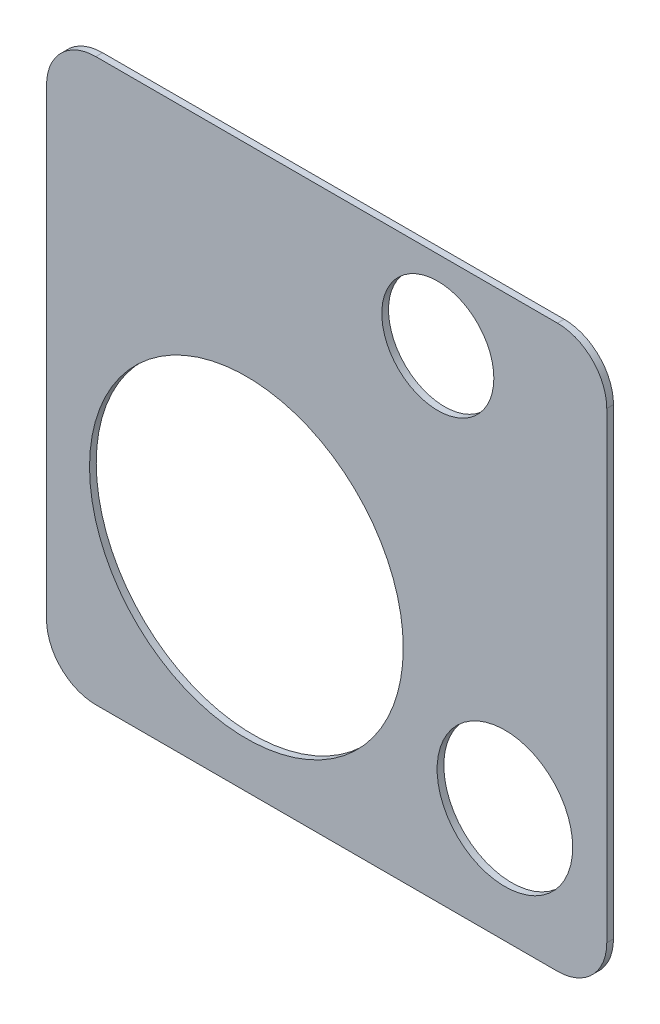
ISO-10303-21;
HEADER;
FILE_DESCRIPTION(('STEP AP214'),'2;1');
FILE_NAME('part.step','',(''),(''),'','','');
FILE_SCHEMA(('AUTOMOTIVE_DESIGN { 1 0 10303 214 1 1 1 1 }'));
ENDSEC;
DATA;
#1=APPLICATION_CONTEXT('core data for automotive mechanical design processes');
#2=APPLICATION_PROTOCOL_DEFINITION('international standard','automotive_design',2000,#1);
#3=PRODUCT_CONTEXT('',#1,'mechanical');
#4=PRODUCT('Part','Part','',(#3));
#5=PRODUCT_RELATED_PRODUCT_CATEGORY('part','',(#4));
#6=PRODUCT_DEFINITION_FORMATION('','',#4);
#7=PRODUCT_DEFINITION_CONTEXT('part definition',#1,'design');
#8=PRODUCT_DEFINITION('design','',#6,#7);
#9=PRODUCT_DEFINITION_SHAPE('','',#8);
#10=(LENGTH_UNIT() NAMED_UNIT(*) SI_UNIT(.MILLI.,.METRE.));
#11=(NAMED_UNIT(*) PLANE_ANGLE_UNIT() SI_UNIT($,.RADIAN.));
#12=(NAMED_UNIT(*) SI_UNIT($,.STERADIAN.) SOLID_ANGLE_UNIT());
#13=UNCERTAINTY_MEASURE_WITH_UNIT(LENGTH_MEASURE(1.E-05),#10,'distance_accuracy_value','');
#14=(GEOMETRIC_REPRESENTATION_CONTEXT(3) GLOBAL_UNCERTAINTY_ASSIGNED_CONTEXT((#13)) GLOBAL_UNIT_ASSIGNED_CONTEXT((#10,
#11,#12)) REPRESENTATION_CONTEXT('',''));
#15=CARTESIAN_POINT('',(0.,0.,0.));
#16=DIRECTION('',(0.,0.,1.));
#17=DIRECTION('',(1.,0.,0.));
#18=AXIS2_PLACEMENT_3D('',#15,#16,#17);
#19=CARTESIAN_POINT('',(0.,0.,6.00000000000001));
#20=DIRECTION('',(1.,0.,0.));
#21=DIRECTION('',(0.,1.,0.));
#22=AXIS2_PLACEMENT_3D('',#19,#20,#21);
#23=PLANE('',#22);
#24=DIRECTION('',(0.,-1.,0.));
#25=VECTOR('',#24,1.);
#26=CARTESIAN_POINT('',(0.,0.,0.));
#27=LINE('',#26,#25);
#28=CARTESIAN_POINT('',(0.,457.,0.));
#29=VERTEX_POINT('',#28);
#30=CARTESIAN_POINT('',(0.,44.,0.));
#31=VERTEX_POINT('',#30);
#32=EDGE_CURVE('E143',#29,#31,#27,.T.);
#33=ORIENTED_EDGE('',*,*,#32,.T.);
#34=DIRECTION('',(0.,0.,-1.));
#35=VECTOR('',#34,1.);
#36=CARTESIAN_POINT('',(0.,44.,6.00000000000001));
#37=LINE('',#36,#35);
#38=CARTESIAN_POINT('',(0.,44.,6.00000000000001));
#39=VERTEX_POINT('',#38);
#40=EDGE_CURVE('E121',#31,#39,#37,.F.);
#41=ORIENTED_EDGE('',*,*,#40,.T.);
#42=DIRECTION('',(0.,-1.,0.));
#43=VECTOR('',#42,1.);
#44=CARTESIAN_POINT('',(0.,0.,6.00000000000001));
#45=LINE('',#44,#43);
#46=CARTESIAN_POINT('',(0.,457.,6.00000000000001));
#47=VERTEX_POINT('',#46);
#48=EDGE_CURVE('E153',#47,#39,#45,.T.);
#49=ORIENTED_EDGE('',*,*,#48,.F.);
#50=DIRECTION('',(0.,0.,-1.));
#51=VECTOR('',#50,1.);
#52=CARTESIAN_POINT('',(0.,457.,6.00000000000001));
#53=LINE('',#52,#51);
#54=EDGE_CURVE('E126',#47,#29,#53,.T.);
#55=ORIENTED_EDGE('',*,*,#54,.T.);
#56=EDGE_LOOP('',(#33,#41,#49,#55));
#57=FACE_BOUND('',#56,.T.);
#58=ADVANCED_FACE('F51',(#57),#23,.F.);
#59=CARTESIAN_POINT('',(0.,0.,6.00000000000001));
#60=DIRECTION('',(0.,1.,0.));
#61=DIRECTION('',(0.,0.,1.));
#62=AXIS2_PLACEMENT_3D('',#59,#60,#61);
#63=PLANE('',#62);
#64=DIRECTION('',(1.,0.,0.));
#65=VECTOR('',#64,1.);
#66=CARTESIAN_POINT('',(0.,0.,6.00000000000001));
#67=LINE('',#66,#65);
#68=CARTESIAN_POINT('',(44.,0.,6.00000000000001));
#69=VERTEX_POINT('',#68);
#70=CARTESIAN_POINT('',(456.,0.,6.00000000000001));
#71=VERTEX_POINT('',#70);
#72=EDGE_CURVE('E136',#69,#71,#67,.T.);
#73=ORIENTED_EDGE('',*,*,#72,.F.);
#74=DIRECTION('',(0.,0.,-1.));
#75=VECTOR('',#74,1.);
#76=CARTESIAN_POINT('',(44.,0.,6.00000000000001));
#77=LINE('',#76,#75);
#78=CARTESIAN_POINT('',(44.,0.,0.));
#79=VERTEX_POINT('',#78);
#80=EDGE_CURVE('E120',#69,#79,#77,.T.);
#81=ORIENTED_EDGE('',*,*,#80,.T.);
#82=DIRECTION('',(1.,0.,0.));
#83=VECTOR('',#82,1.);
#84=CARTESIAN_POINT('',(0.,0.,0.));
#85=LINE('',#84,#83);
#86=CARTESIAN_POINT('',(456.,0.,0.));
#87=VERTEX_POINT('',#86);
#88=EDGE_CURVE('E133',#79,#87,#85,.T.);
#89=ORIENTED_EDGE('',*,*,#88,.T.);
#90=DIRECTION('',(0.,0.,-1.));
#91=VECTOR('',#90,1.);
#92=CARTESIAN_POINT('',(456.,0.,6.00000000000001));
#93=LINE('',#92,#91);
#94=EDGE_CURVE('E138',#87,#71,#93,.F.);
#95=ORIENTED_EDGE('',*,*,#94,.T.);
#96=EDGE_LOOP('',(#73,#81,#89,#95));
#97=FACE_BOUND('',#96,.T.);
#98=ADVANCED_FACE('F132',(#97),#63,.F.);
#99=CARTESIAN_POINT('',(500.,0.,6.00000000000001));
#100=DIRECTION('',(-1.,0.,0.));
#101=DIRECTION('',(0.,-1.,0.));
#102=AXIS2_PLACEMENT_3D('',#99,#100,#101);
#103=PLANE('',#102);
#104=DIRECTION('',(0.,1.,0.));
#105=VECTOR('',#104,1.);
#106=CARTESIAN_POINT('',(500.,0.,6.00000000000001));
#107=LINE('',#106,#105);
#108=CARTESIAN_POINT('',(500.,44.,6.00000000000001));
#109=VERTEX_POINT('',#108);
#110=CARTESIAN_POINT('',(500.,457.,6.00000000000001));
#111=VERTEX_POINT('',#110);
#112=EDGE_CURVE('E187',#109,#111,#107,.T.);
#113=ORIENTED_EDGE('',*,*,#112,.F.);
#114=DIRECTION('',(0.,0.,-1.));
#115=VECTOR('',#114,1.);
#116=CARTESIAN_POINT('',(500.,44.,6.00000000000001));
#117=LINE('',#116,#115);
#118=CARTESIAN_POINT('',(500.,44.,0.));
#119=VERTEX_POINT('',#118);
#120=EDGE_CURVE('E172',#109,#119,#117,.T.);
#121=ORIENTED_EDGE('',*,*,#120,.T.);
#122=DIRECTION('',(0.,1.,0.));
#123=VECTOR('',#122,1.);
#124=CARTESIAN_POINT('',(500.,0.,0.));
#125=LINE('',#124,#123);
#126=CARTESIAN_POINT('',(500.,457.,0.));
#127=VERTEX_POINT('',#126);
#128=EDGE_CURVE('E142',#119,#127,#125,.T.);
#129=ORIENTED_EDGE('',*,*,#128,.T.);
#130=DIRECTION('',(0.,0.,-1.));
#131=VECTOR('',#130,1.);
#132=CARTESIAN_POINT('',(500.,457.,6.00000000000001));
#133=LINE('',#132,#131);
#134=EDGE_CURVE('E170',#127,#111,#133,.F.);
#135=ORIENTED_EDGE('',*,*,#134,.T.);
#136=EDGE_LOOP('',(#113,#121,#129,#135));
#137=FACE_BOUND('',#136,.T.);
#138=ADVANCED_FACE('F203',(#137),#103,.F.);
#139=CARTESIAN_POINT('',(-1.11022302462516E-13,501.,6.00000000000001));
#140=DIRECTION('',(0.,-1.,0.));
#141=DIRECTION('',(0.,0.,-1.));
#142=AXIS2_PLACEMENT_3D('',#139,#140,#141);
#143=PLANE('',#142);
#144=DIRECTION('',(-1.,0.,0.));
#145=VECTOR('',#144,1.);
#146=CARTESIAN_POINT('',(-1.11022302462516E-13,501.,0.));
#147=LINE('',#146,#145);
#148=CARTESIAN_POINT('',(456.,501.,0.));
#149=VERTEX_POINT('',#148);
#150=CARTESIAN_POINT('',(43.9999999999999,501.,0.));
#151=VERTEX_POINT('',#150);
#152=EDGE_CURVE('E146',#149,#151,#147,.T.);
#153=ORIENTED_EDGE('',*,*,#152,.T.);
#154=DIRECTION('',(0.,0.,-1.));
#155=VECTOR('',#154,1.);
#156=CARTESIAN_POINT('',(43.9999999999999,501.,6.00000000000001));
#157=LINE('',#156,#155);
#158=CARTESIAN_POINT('',(43.9999999999999,501.,6.00000000000001));
#159=VERTEX_POINT('',#158);
#160=EDGE_CURVE('E13',#151,#159,#157,.F.);
#161=ORIENTED_EDGE('',*,*,#160,.T.);
#162=DIRECTION('',(-1.,0.,0.));
#163=VECTOR('',#162,1.);
#164=CARTESIAN_POINT('',(-1.11022302462516E-13,501.,6.00000000000001));
#165=LINE('',#164,#163);
#166=CARTESIAN_POINT('',(456.,501.,6.00000000000001));
#167=VERTEX_POINT('',#166);
#168=EDGE_CURVE('E154',#167,#159,#165,.T.);
#169=ORIENTED_EDGE('',*,*,#168,.F.);
#170=DIRECTION('',(0.,0.,-1.));
#171=VECTOR('',#170,1.);
#172=CARTESIAN_POINT('',(456.,501.,6.00000000000001));
#173=LINE('',#172,#171);
#174=EDGE_CURVE('E59',#167,#149,#173,.T.);
#175=ORIENTED_EDGE('',*,*,#174,.T.);
#176=EDGE_LOOP('',(#153,#161,#169,#175));
#177=FACE_BOUND('',#176,.T.);
#178=ADVANCED_FACE('F177',(#177),#143,.F.);
#179=CARTESIAN_POINT('',(0.,0.,6.00000000000001));
#180=DIRECTION('',(0.,0.,-1.));
#181=DIRECTION('',(-1.,0.,0.));
#182=AXIS2_PLACEMENT_3D('',#179,#180,#181);
#183=PLANE('',#182);
#184=CARTESIAN_POINT('',(349.228645131333,430.,6.00000000000001));
#185=DIRECTION('',(0.,0.,1.));
#186=DIRECTION('',(1.,0.,0.));
#187=AXIS2_PLACEMENT_3D('',#184,#185,#186);
#188=CIRCLE('',#187,50.);
#189=CARTESIAN_POINT('',(399.228645131333,430.,6.00000000000001));
#190=VERTEX_POINT('',#189);
#191=EDGE_CURVE('E292',#190,#190,#188,.T.);
#192=ORIENTED_EDGE('',*,*,#191,.F.);
#193=EDGE_LOOP('',(#192));
#194=FACE_BOUND('',#193,.T.);
#195=CARTESIAN_POINT('',(409.103373263516,102.516190164631,6.00000000000001));
#196=DIRECTION('',(0.,0.,1.));
#197=DIRECTION('',(1.,0.,0.));
#198=AXIS2_PLACEMENT_3D('',#195,#196,#197);
#199=CIRCLE('',#198,60.5);
#200=CARTESIAN_POINT('',(469.603373263516,102.516190164631,6.00000000000001));
#201=VERTEX_POINT('',#200);
#202=EDGE_CURVE('E294',#201,#201,#199,.T.);
#203=ORIENTED_EDGE('',*,*,#202,.F.);
#204=EDGE_LOOP('',(#203));
#205=FACE_BOUND('',#204,.T.);
#206=CARTESIAN_POINT('',(178.369044071837,181.034738008964,6.00000000000001));
#207=DIRECTION('',(0.,0.,1.));
#208=DIRECTION('',(1.,0.,0.));
#209=AXIS2_PLACEMENT_3D('',#206,#207,#208);
#210=CIRCLE('',#209,140.);
#211=CARTESIAN_POINT('',(318.369044071837,181.034738008964,6.00000000000001));
#212=VERTEX_POINT('',#211);
#213=EDGE_CURVE('E190',#212,#212,#210,.T.);
#214=ORIENTED_EDGE('',*,*,#213,.F.);
#215=EDGE_LOOP('',(#214));
#216=FACE_BOUND('',#215,.T.);
#217=ORIENTED_EDGE('',*,*,#48,.T.);
#218=CARTESIAN_POINT('',(44.,44.,6.00000000000001));
#219=DIRECTION('',(0.,0.,-1.));
#220=DIRECTION('',(-1.,0.,0.));
#221=AXIS2_PLACEMENT_3D('',#218,#219,#220);
#222=CIRCLE('',#221,44.);
#223=EDGE_CURVE('E168',#39,#69,#222,.F.);
#224=ORIENTED_EDGE('',*,*,#223,.T.);
#225=ORIENTED_EDGE('',*,*,#72,.T.);
#226=CARTESIAN_POINT('',(456.,44.,6.00000000000001));
#227=DIRECTION('',(0.,0.,-1.));
#228=DIRECTION('',(-1.,0.,0.));
#229=AXIS2_PLACEMENT_3D('',#226,#227,#228);
#230=CIRCLE('',#229,44.);
#231=EDGE_CURVE('E166',#71,#109,#230,.F.);
#232=ORIENTED_EDGE('',*,*,#231,.T.);
#233=ORIENTED_EDGE('',*,*,#112,.T.);
#234=CARTESIAN_POINT('',(456.,457.,6.00000000000001));
#235=DIRECTION('',(0.,0.,-1.));
#236=DIRECTION('',(-1.,0.,0.));
#237=AXIS2_PLACEMENT_3D('',#234,#235,#236);
#238=CIRCLE('',#237,44.);
#239=EDGE_CURVE('E71',#111,#167,#238,.F.);
#240=ORIENTED_EDGE('',*,*,#239,.T.);
#241=ORIENTED_EDGE('',*,*,#168,.T.);
#242=CARTESIAN_POINT('',(43.9999999999999,457.,6.00000000000001));
#243=DIRECTION('',(0.,0.,-1.));
#244=DIRECTION('',(-1.,0.,0.));
#245=AXIS2_PLACEMENT_3D('',#242,#243,#244);
#246=CIRCLE('',#245,44.);
#247=EDGE_CURVE('E164',#159,#47,#246,.F.);
#248=ORIENTED_EDGE('',*,*,#247,.T.);
#249=EDGE_LOOP('',(#217,#224,#225,#232,#233,#240,#241,#248));
#250=FACE_BOUND('',#249,.T.);
#251=ADVANCED_FACE('F193',(#194,#205,#216,#250),#183,.F.);
#252=CARTESIAN_POINT('',(0.,0.,0.));
#253=DIRECTION('',(0.,0.,-1.));
#254=DIRECTION('',(-1.,0.,0.));
#255=AXIS2_PLACEMENT_3D('',#252,#253,#254);
#256=PLANE('',#255);
#257=CARTESIAN_POINT('',(349.228645131333,430.,0.));
#258=DIRECTION('',(0.,0.,1.));
#259=DIRECTION('',(1.,0.,0.));
#260=AXIS2_PLACEMENT_3D('',#257,#258,#259);
#261=CIRCLE('',#260,50.);
#262=CARTESIAN_POINT('',(399.228645131333,430.,0.));
#263=VERTEX_POINT('',#262);
#264=EDGE_CURVE('E290',#263,#263,#261,.T.);
#265=ORIENTED_EDGE('',*,*,#264,.T.);
#266=EDGE_LOOP('',(#265));
#267=FACE_BOUND('',#266,.T.);
#268=CARTESIAN_POINT('',(409.103373263516,102.516190164631,0.));
#269=DIRECTION('',(0.,0.,1.));
#270=DIRECTION('',(1.,0.,0.));
#271=AXIS2_PLACEMENT_3D('',#268,#269,#270);
#272=CIRCLE('',#271,60.5);
#273=CARTESIAN_POINT('',(469.603373263516,102.516190164631,0.));
#274=VERTEX_POINT('',#273);
#275=EDGE_CURVE('E297',#274,#274,#272,.T.);
#276=ORIENTED_EDGE('',*,*,#275,.T.);
#277=EDGE_LOOP('',(#276));
#278=FACE_BOUND('',#277,.T.);
#279=CARTESIAN_POINT('',(178.369044071837,181.034738008964,0.));
#280=DIRECTION('',(0.,0.,1.));
#281=DIRECTION('',(1.,0.,0.));
#282=AXIS2_PLACEMENT_3D('',#279,#280,#281);
#283=CIRCLE('',#282,140.);
#284=CARTESIAN_POINT('',(318.369044071837,181.034738008964,0.));
#285=VERTEX_POINT('',#284);
#286=EDGE_CURVE('E148',#285,#285,#283,.T.);
#287=ORIENTED_EDGE('',*,*,#286,.T.);
#288=EDGE_LOOP('',(#287));
#289=FACE_BOUND('',#288,.T.);
#290=ORIENTED_EDGE('',*,*,#88,.F.);
#291=CARTESIAN_POINT('',(44.,44.,0.));
#292=DIRECTION('',(0.,0.,-1.));
#293=DIRECTION('',(-1.,0.,0.));
#294=AXIS2_PLACEMENT_3D('',#291,#292,#293);
#295=CIRCLE('',#294,44.);
#296=EDGE_CURVE('E116',#79,#31,#295,.T.);
#297=ORIENTED_EDGE('',*,*,#296,.T.);
#298=ORIENTED_EDGE('',*,*,#32,.F.);
#299=CARTESIAN_POINT('',(43.9999999999999,457.,0.));
#300=DIRECTION('',(0.,0.,-1.));
#301=DIRECTION('',(-1.,0.,0.));
#302=AXIS2_PLACEMENT_3D('',#299,#300,#301);
#303=CIRCLE('',#302,44.);
#304=EDGE_CURVE('E157',#29,#151,#303,.T.);
#305=ORIENTED_EDGE('',*,*,#304,.T.);
#306=ORIENTED_EDGE('',*,*,#152,.F.);
#307=CARTESIAN_POINT('',(456.,457.,0.));
#308=DIRECTION('',(0.,0.,-1.));
#309=DIRECTION('',(-1.,0.,0.));
#310=AXIS2_PLACEMENT_3D('',#307,#308,#309);
#311=CIRCLE('',#310,44.);
#312=EDGE_CURVE('E137',#149,#127,#311,.T.);
#313=ORIENTED_EDGE('',*,*,#312,.T.);
#314=ORIENTED_EDGE('',*,*,#128,.F.);
#315=CARTESIAN_POINT('',(456.,44.,0.));
#316=DIRECTION('',(0.,0.,-1.));
#317=DIRECTION('',(-1.,0.,0.));
#318=AXIS2_PLACEMENT_3D('',#315,#316,#317);
#319=CIRCLE('',#318,44.);
#320=EDGE_CURVE('E127',#119,#87,#319,.T.);
#321=ORIENTED_EDGE('',*,*,#320,.T.);
#322=EDGE_LOOP('',(#290,#297,#298,#305,#306,#313,#314,#321));
#323=FACE_BOUND('',#322,.T.);
#324=ADVANCED_FACE('F140',(#267,#278,#289,#323),#256,.T.);
#325=CARTESIAN_POINT('',(44.,44.,6.00000000000001));
#326=DIRECTION('',(0.,0.,-1.));
#327=DIRECTION('',(-1.,0.,0.));
#328=AXIS2_PLACEMENT_3D('',#325,#326,#327);
#329=CYLINDRICAL_SURFACE('',#328,44.);
#330=ORIENTED_EDGE('',*,*,#223,.F.);
#331=ORIENTED_EDGE('',*,*,#40,.F.);
#332=ORIENTED_EDGE('',*,*,#296,.F.);
#333=ORIENTED_EDGE('',*,*,#80,.F.);
#334=EDGE_LOOP('',(#330,#331,#332,#333));
#335=FACE_BOUND('',#334,.T.);
#336=ADVANCED_FACE('F119',(#335),#329,.T.);
#337=CARTESIAN_POINT('',(456.,44.,6.00000000000001));
#338=DIRECTION('',(0.,0.,-1.));
#339=DIRECTION('',(-1.,0.,0.));
#340=AXIS2_PLACEMENT_3D('',#337,#338,#339);
#341=CYLINDRICAL_SURFACE('',#340,44.);
#342=ORIENTED_EDGE('',*,*,#231,.F.);
#343=ORIENTED_EDGE('',*,*,#94,.F.);
#344=ORIENTED_EDGE('',*,*,#320,.F.);
#345=ORIENTED_EDGE('',*,*,#120,.F.);
#346=EDGE_LOOP('',(#342,#343,#344,#345));
#347=FACE_BOUND('',#346,.T.);
#348=ADVANCED_FACE('F218',(#347),#341,.T.);
#349=CARTESIAN_POINT('',(43.9999999999999,457.,6.00000000000001));
#350=DIRECTION('',(0.,0.,-1.));
#351=DIRECTION('',(-1.,0.,0.));
#352=AXIS2_PLACEMENT_3D('',#349,#350,#351);
#353=CYLINDRICAL_SURFACE('',#352,44.);
#354=ORIENTED_EDGE('',*,*,#247,.F.);
#355=ORIENTED_EDGE('',*,*,#160,.F.);
#356=ORIENTED_EDGE('',*,*,#304,.F.);
#357=ORIENTED_EDGE('',*,*,#54,.F.);
#358=EDGE_LOOP('',(#354,#355,#356,#357));
#359=FACE_BOUND('',#358,.T.);
#360=ADVANCED_FACE('F182',(#359),#353,.T.);
#361=CARTESIAN_POINT('',(456.,457.,6.00000000000001));
#362=DIRECTION('',(0.,0.,-1.));
#363=DIRECTION('',(-1.,0.,0.));
#364=AXIS2_PLACEMENT_3D('',#361,#362,#363);
#365=CYLINDRICAL_SURFACE('',#364,44.);
#366=ORIENTED_EDGE('',*,*,#239,.F.);
#367=ORIENTED_EDGE('',*,*,#134,.F.);
#368=ORIENTED_EDGE('',*,*,#312,.F.);
#369=ORIENTED_EDGE('',*,*,#174,.F.);
#370=EDGE_LOOP('',(#366,#367,#368,#369));
#371=FACE_BOUND('',#370,.T.);
#372=ADVANCED_FACE('F53',(#371),#365,.T.);
#373=CARTESIAN_POINT('',(178.369044071837,181.034738008964,0.));
#374=DIRECTION('',(0.,0.,1.));
#375=DIRECTION('',(1.,0.,0.));
#376=AXIS2_PLACEMENT_3D('',#373,#374,#375);
#377=CYLINDRICAL_SURFACE('',#376,140.);
#378=ORIENTED_EDGE('',*,*,#286,.F.);
#379=EDGE_LOOP('',(#378));
#380=FACE_BOUND('',#379,.T.);
#381=ORIENTED_EDGE('',*,*,#213,.T.);
#382=EDGE_LOOP('',(#381));
#383=FACE_BOUND('',#382,.T.);
#384=ADVANCED_FACE('F225',(#380,#383),#377,.F.);
#385=CARTESIAN_POINT('',(409.103373263516,102.516190164631,0.));
#386=DIRECTION('',(0.,0.,1.));
#387=DIRECTION('',(1.,0.,0.));
#388=AXIS2_PLACEMENT_3D('',#385,#386,#387);
#389=CYLINDRICAL_SURFACE('',#388,60.5);
#390=ORIENTED_EDGE('',*,*,#275,.F.);
#391=EDGE_LOOP('',(#390));
#392=FACE_BOUND('',#391,.T.);
#393=ORIENTED_EDGE('',*,*,#202,.T.);
#394=EDGE_LOOP('',(#393));
#395=FACE_BOUND('',#394,.T.);
#396=ADVANCED_FACE('F229',(#392,#395),#389,.F.);
#397=CARTESIAN_POINT('',(349.228645131333,430.,0.));
#398=DIRECTION('',(0.,0.,1.));
#399=DIRECTION('',(1.,0.,0.));
#400=AXIS2_PLACEMENT_3D('',#397,#398,#399);
#401=CYLINDRICAL_SURFACE('',#400,50.);
#402=ORIENTED_EDGE('',*,*,#264,.F.);
#403=EDGE_LOOP('',(#402));
#404=FACE_BOUND('',#403,.T.);
#405=ORIENTED_EDGE('',*,*,#191,.T.);
#406=EDGE_LOOP('',(#405));
#407=FACE_BOUND('',#406,.T.);
#408=ADVANCED_FACE('F274',(#404,#407),#401,.F.);
#409=CLOSED_SHELL('',(#58,#98,#138,#178,#251,#324,#336,#348,#360,#372,#384,#396,#408));
#410=MANIFOLD_SOLID_BREP('B2',#409);
#411=ADVANCED_BREP_SHAPE_REPRESENTATION('',(#18,#410),#14);
#412=SHAPE_DEFINITION_REPRESENTATION(#9,#411);
ENDSEC;
END-ISO-10303-21;
